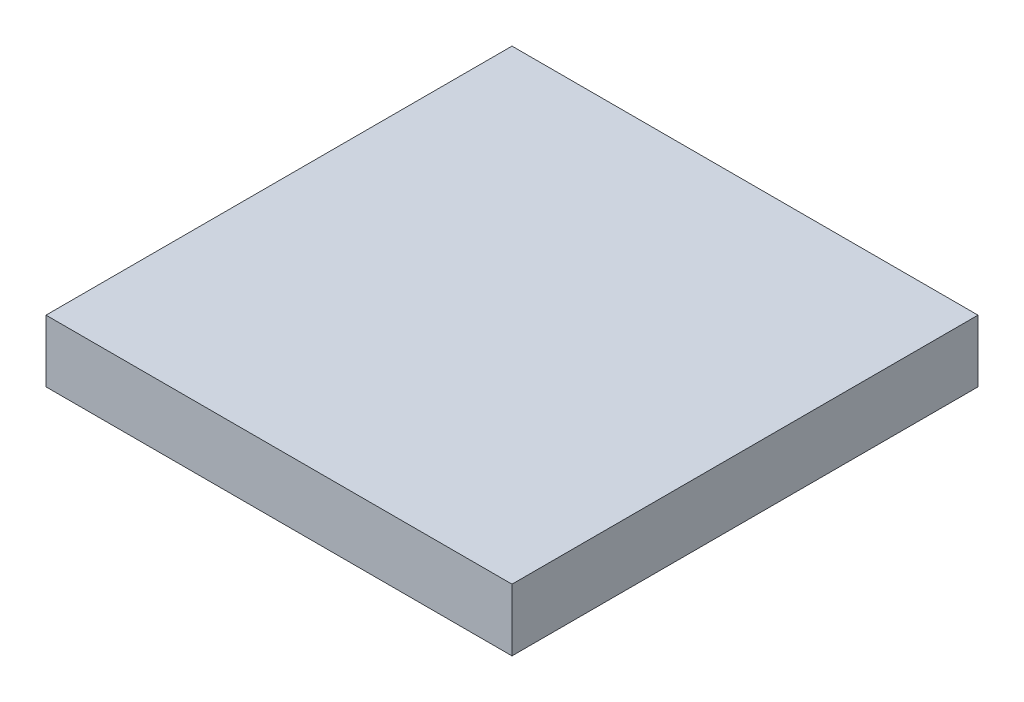
ISO-10303-21;
HEADER;
FILE_DESCRIPTION(('STEP AP214'),'2;1');
FILE_NAME('part.step','',(''),(''),'','','');
FILE_SCHEMA(('AUTOMOTIVE_DESIGN { 1 0 10303 214 1 1 1 1 }'));
ENDSEC;
DATA;
#1=APPLICATION_CONTEXT('core data for automotive mechanical design processes');
#2=APPLICATION_PROTOCOL_DEFINITION('international standard','automotive_design',2000,#1);
#3=PRODUCT_CONTEXT('',#1,'mechanical');
#4=PRODUCT('Part','Part','',(#3));
#5=PRODUCT_RELATED_PRODUCT_CATEGORY('part','',(#4));
#6=PRODUCT_DEFINITION_FORMATION('','',#4);
#7=PRODUCT_DEFINITION_CONTEXT('part definition',#1,'design');
#8=PRODUCT_DEFINITION('design','',#6,#7);
#9=PRODUCT_DEFINITION_SHAPE('','',#8);
#10=(LENGTH_UNIT() NAMED_UNIT(*) SI_UNIT(.MILLI.,.METRE.));
#11=(NAMED_UNIT(*) PLANE_ANGLE_UNIT() SI_UNIT($,.RADIAN.));
#12=(NAMED_UNIT(*) SI_UNIT($,.STERADIAN.) SOLID_ANGLE_UNIT());
#13=UNCERTAINTY_MEASURE_WITH_UNIT(LENGTH_MEASURE(1.E-05),#10,'distance_accuracy_value','');
#14=(GEOMETRIC_REPRESENTATION_CONTEXT(3) GLOBAL_UNCERTAINTY_ASSIGNED_CONTEXT((#13)) GLOBAL_UNIT_ASSIGNED_CONTEXT((#10,
#11,#12)) REPRESENTATION_CONTEXT('',''));
#15=CARTESIAN_POINT('',(0.,0.,0.));
#16=DIRECTION('',(0.,0.,1.));
#17=DIRECTION('',(1.,0.,0.));
#18=AXIS2_PLACEMENT_3D('',#15,#16,#17);
#19=CARTESIAN_POINT('',(0.,2.,0.));
#20=DIRECTION('',(1.,0.,0.));
#21=DIRECTION('',(0.,0.,-1.));
#22=AXIS2_PLACEMENT_3D('',#19,#20,#21);
#23=PLANE('',#22);
#24=DIRECTION('',(0.,0.,1.));
#25=VECTOR('',#24,1.);
#26=CARTESIAN_POINT('',(0.,0.,0.));
#27=LINE('',#26,#25);
#28=CARTESIAN_POINT('',(0.,0.,-15.));
#29=VERTEX_POINT('',#28);
#30=CARTESIAN_POINT('',(0.,0.,0.));
#31=VERTEX_POINT('',#30);
#32=EDGE_CURVE('E102',#29,#31,#27,.T.);
#33=ORIENTED_EDGE('',*,*,#32,.T.);
#34=DIRECTION('',(0.,-1.,0.));
#35=VECTOR('',#34,1.);
#36=CARTESIAN_POINT('',(0.,2.,0.));
#37=LINE('',#36,#35);
#38=CARTESIAN_POINT('',(0.,2.,0.));
#39=VERTEX_POINT('',#38);
#40=EDGE_CURVE('E11',#39,#31,#37,.T.);
#41=ORIENTED_EDGE('',*,*,#40,.F.);
#42=DIRECTION('',(0.,0.,1.));
#43=VECTOR('',#42,1.);
#44=CARTESIAN_POINT('',(0.,2.,0.));
#45=LINE('',#44,#43);
#46=CARTESIAN_POINT('',(0.,2.,-15.));
#47=VERTEX_POINT('',#46);
#48=EDGE_CURVE('E90',#47,#39,#45,.T.);
#49=ORIENTED_EDGE('',*,*,#48,.F.);
#50=DIRECTION('',(0.,-1.,0.));
#51=VECTOR('',#50,1.);
#52=CARTESIAN_POINT('',(0.,2.,-15.));
#53=LINE('',#52,#51);
#54=EDGE_CURVE('E98',#47,#29,#53,.T.);
#55=ORIENTED_EDGE('',*,*,#54,.T.);
#56=EDGE_LOOP('',(#33,#41,#49,#55));
#57=FACE_BOUND('',#56,.T.);
#58=ADVANCED_FACE('F39',(#57),#23,.F.);
#59=CARTESIAN_POINT('',(0.,2.,0.));
#60=DIRECTION('',(0.,0.,-1.));
#61=DIRECTION('',(-1.,0.,0.));
#62=AXIS2_PLACEMENT_3D('',#59,#60,#61);
#63=PLANE('',#62);
#64=DIRECTION('',(1.,0.,0.));
#65=VECTOR('',#64,1.);
#66=CARTESIAN_POINT('',(0.,0.,0.));
#67=LINE('',#66,#65);
#68=CARTESIAN_POINT('',(15.,0.,0.));
#69=VERTEX_POINT('',#68);
#70=EDGE_CURVE('E94',#31,#69,#67,.T.);
#71=ORIENTED_EDGE('',*,*,#70,.T.);
#72=DIRECTION('',(0.,-1.,0.));
#73=VECTOR('',#72,1.);
#74=CARTESIAN_POINT('',(15.,2.,0.));
#75=LINE('',#74,#73);
#76=CARTESIAN_POINT('',(15.,2.,0.));
#77=VERTEX_POINT('',#76);
#78=EDGE_CURVE('E47',#77,#69,#75,.T.);
#79=ORIENTED_EDGE('',*,*,#78,.F.);
#80=DIRECTION('',(1.,0.,0.));
#81=VECTOR('',#80,1.);
#82=CARTESIAN_POINT('',(0.,2.,0.));
#83=LINE('',#82,#81);
#84=EDGE_CURVE('E85',#39,#77,#83,.T.);
#85=ORIENTED_EDGE('',*,*,#84,.F.);
#86=ORIENTED_EDGE('',*,*,#40,.T.);
#87=EDGE_LOOP('',(#71,#79,#85,#86));
#88=FACE_BOUND('',#87,.T.);
#89=ADVANCED_FACE('F93',(#88),#63,.F.);
#90=CARTESIAN_POINT('',(15.,2.,0.));
#91=DIRECTION('',(-1.,0.,0.));
#92=DIRECTION('',(0.,0.,1.));
#93=AXIS2_PLACEMENT_3D('',#90,#91,#92);
#94=PLANE('',#93);
#95=DIRECTION('',(0.,0.,-1.));
#96=VECTOR('',#95,1.);
#97=CARTESIAN_POINT('',(15.,0.,0.));
#98=LINE('',#97,#96);
#99=CARTESIAN_POINT('',(15.,0.,-15.));
#100=VERTEX_POINT('',#99);
#101=EDGE_CURVE('E72',#69,#100,#98,.T.);
#102=ORIENTED_EDGE('',*,*,#101,.T.);
#103=DIRECTION('',(0.,-1.,0.));
#104=VECTOR('',#103,1.);
#105=CARTESIAN_POINT('',(15.,2.,-15.));
#106=LINE('',#105,#104);
#107=CARTESIAN_POINT('',(15.,2.,-15.));
#108=VERTEX_POINT('',#107);
#109=EDGE_CURVE('E95',#108,#100,#106,.T.);
#110=ORIENTED_EDGE('',*,*,#109,.F.);
#111=DIRECTION('',(0.,0.,-1.));
#112=VECTOR('',#111,1.);
#113=CARTESIAN_POINT('',(15.,2.,0.));
#114=LINE('',#113,#112);
#115=EDGE_CURVE('E88',#77,#108,#114,.T.);
#116=ORIENTED_EDGE('',*,*,#115,.F.);
#117=ORIENTED_EDGE('',*,*,#78,.T.);
#118=EDGE_LOOP('',(#102,#110,#116,#117));
#119=FACE_BOUND('',#118,.T.);
#120=ADVANCED_FACE('F96',(#119),#94,.F.);
#121=CARTESIAN_POINT('',(0.,2.,-15.));
#122=DIRECTION('',(0.,0.,1.));
#123=DIRECTION('',(1.,0.,0.));
#124=AXIS2_PLACEMENT_3D('',#121,#122,#123);
#125=PLANE('',#124);
#126=DIRECTION('',(-1.,0.,0.));
#127=VECTOR('',#126,1.);
#128=CARTESIAN_POINT('',(0.,0.,-15.));
#129=LINE('',#128,#127);
#130=EDGE_CURVE('E78',#100,#29,#129,.T.);
#131=ORIENTED_EDGE('',*,*,#130,.T.);
#132=ORIENTED_EDGE('',*,*,#54,.F.);
#133=DIRECTION('',(-1.,0.,0.));
#134=VECTOR('',#133,1.);
#135=CARTESIAN_POINT('',(0.,2.,-15.));
#136=LINE('',#135,#134);
#137=EDGE_CURVE('E55',#108,#47,#136,.T.);
#138=ORIENTED_EDGE('',*,*,#137,.F.);
#139=ORIENTED_EDGE('',*,*,#109,.T.);
#140=EDGE_LOOP('',(#131,#132,#138,#139));
#141=FACE_BOUND('',#140,.T.);
#142=ADVANCED_FACE('F109',(#141),#125,.F.);
#143=CARTESIAN_POINT('',(0.,2.,0.));
#144=DIRECTION('',(0.,-1.,0.));
#145=DIRECTION('',(0.,0.,-1.));
#146=AXIS2_PLACEMENT_3D('',#143,#144,#145);
#147=PLANE('',#146);
#148=ORIENTED_EDGE('',*,*,#48,.T.);
#149=ORIENTED_EDGE('',*,*,#84,.T.);
#150=ORIENTED_EDGE('',*,*,#115,.T.);
#151=ORIENTED_EDGE('',*,*,#137,.T.);
#152=EDGE_LOOP('',(#148,#149,#150,#151));
#153=FACE_BOUND('',#152,.T.);
#154=ADVANCED_FACE('F86',(#153),#147,.F.);
#155=CARTESIAN_POINT('',(0.,0.,0.));
#156=DIRECTION('',(0.,-1.,0.));
#157=DIRECTION('',(0.,0.,-1.));
#158=AXIS2_PLACEMENT_3D('',#155,#156,#157);
#159=PLANE('',#158);
#160=ORIENTED_EDGE('',*,*,#32,.F.);
#161=ORIENTED_EDGE('',*,*,#130,.F.);
#162=ORIENTED_EDGE('',*,*,#101,.F.);
#163=ORIENTED_EDGE('',*,*,#70,.F.);
#164=EDGE_LOOP('',(#160,#161,#162,#163));
#165=FACE_BOUND('',#164,.T.);
#166=ADVANCED_FACE('F112',(#165),#159,.T.);
#167=CLOSED_SHELL('',(#58,#89,#120,#142,#154,#166));
#168=MANIFOLD_SOLID_BREP('B2',#167);
#169=ADVANCED_BREP_SHAPE_REPRESENTATION('',(#18,#168),#14);
#170=SHAPE_DEFINITION_REPRESENTATION(#9,#169);
ENDSEC;
END-ISO-10303-21;
